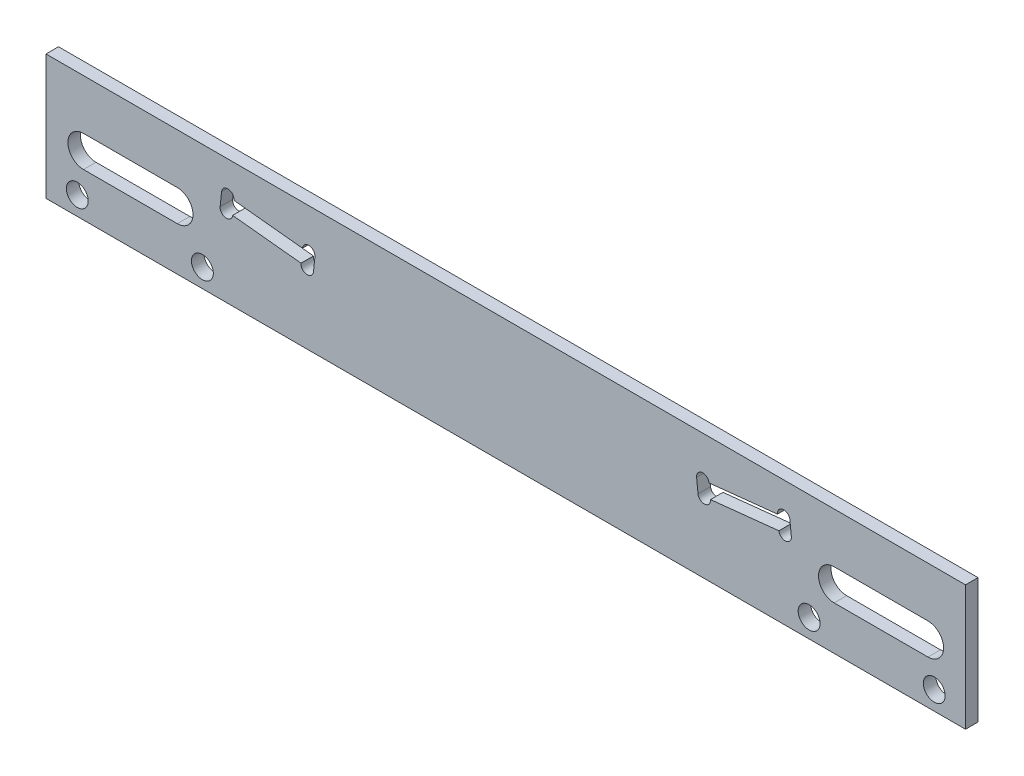
ISO-10303-21;
HEADER;
FILE_DESCRIPTION(('STEP AP214'),'2;1');
FILE_NAME('part.step','',(''),(''),'','','');
FILE_SCHEMA(('AUTOMOTIVE_DESIGN { 1 0 10303 214 1 1 1 1 }'));
ENDSEC;
DATA;
#1=APPLICATION_CONTEXT('core data for automotive mechanical design processes');
#2=APPLICATION_PROTOCOL_DEFINITION('international standard','automotive_design',2000,#1);
#3=PRODUCT_CONTEXT('',#1,'mechanical');
#4=PRODUCT('Part','Part','',(#3));
#5=PRODUCT_RELATED_PRODUCT_CATEGORY('part','',(#4));
#6=PRODUCT_DEFINITION_FORMATION('','',#4);
#7=PRODUCT_DEFINITION_CONTEXT('part definition',#1,'design');
#8=PRODUCT_DEFINITION('design','',#6,#7);
#9=PRODUCT_DEFINITION_SHAPE('','',#8);
#10=(LENGTH_UNIT() NAMED_UNIT(*) SI_UNIT(.MILLI.,.METRE.));
#11=(NAMED_UNIT(*) PLANE_ANGLE_UNIT() SI_UNIT($,.RADIAN.));
#12=(NAMED_UNIT(*) SI_UNIT($,.STERADIAN.) SOLID_ANGLE_UNIT());
#13=UNCERTAINTY_MEASURE_WITH_UNIT(LENGTH_MEASURE(1.E-05),#10,'distance_accuracy_value','');
#14=(GEOMETRIC_REPRESENTATION_CONTEXT(3) GLOBAL_UNCERTAINTY_ASSIGNED_CONTEXT((#13)) GLOBAL_UNIT_ASSIGNED_CONTEXT((#10,
#11,#12)) REPRESENTATION_CONTEXT('',''));
#15=CARTESIAN_POINT('',(0.,0.,0.));
#16=DIRECTION('',(0.,0.,1.));
#17=DIRECTION('',(1.,0.,0.));
#18=AXIS2_PLACEMENT_3D('',#15,#16,#17);
#19=CARTESIAN_POINT('',(0.,0.,2.));
#20=DIRECTION('',(0.,0.,1.));
#21=DIRECTION('',(1.,0.,0.));
#22=AXIS2_PLACEMENT_3D('',#19,#20,#21);
#23=PLANE('',#22);
#24=CARTESIAN_POINT('',(52.5,-0.499999999999997,2.));
#25=DIRECTION('',(0.,0.,1.));
#26=DIRECTION('',(1.,0.,0.));
#27=AXIS2_PLACEMENT_3D('',#24,#25,#26);
#28=CIRCLE('',#27,2.5);
#29=CARTESIAN_POINT('',(52.5,2.,2.));
#30=VERTEX_POINT('',#29);
#31=CARTESIAN_POINT('',(52.5,-3.,2.));
#32=VERTEX_POINT('',#31);
#33=EDGE_CURVE('E254',#30,#32,#28,.T.);
#34=ORIENTED_EDGE('',*,*,#33,.F.);
#35=DIRECTION('',(-1.,0.,0.));
#36=VECTOR('',#35,1.);
#37=CARTESIAN_POINT('',(52.5,2.,2.));
#38=LINE('',#37,#36);
#39=CARTESIAN_POINT('',(67.5,2.,2.));
#40=VERTEX_POINT('',#39);
#41=EDGE_CURVE('E262',#40,#30,#38,.T.);
#42=ORIENTED_EDGE('',*,*,#41,.F.);
#43=CARTESIAN_POINT('',(67.5,-0.499999999999997,2.));
#44=DIRECTION('',(0.,0.,1.));
#45=DIRECTION('',(1.,0.,0.));
#46=AXIS2_PLACEMENT_3D('',#43,#44,#45);
#47=CIRCLE('',#46,2.5);
#48=CARTESIAN_POINT('',(67.5,-3.,2.));
#49=VERTEX_POINT('',#48);
#50=EDGE_CURVE('E276',#49,#40,#47,.T.);
#51=ORIENTED_EDGE('',*,*,#50,.F.);
#52=DIRECTION('',(1.,0.,0.));
#53=VECTOR('',#52,1.);
#54=CARTESIAN_POINT('',(52.5,-3.,2.));
#55=LINE('',#54,#53);
#56=EDGE_CURVE('E273',#32,#49,#55,.T.);
#57=ORIENTED_EDGE('',*,*,#56,.F.);
#58=EDGE_LOOP('',(#34,#42,#51,#57));
#59=FACE_BOUND('',#58,.T.);
#60=CARTESIAN_POINT('',(-68.5,-6.99999999999999,2.));
#61=DIRECTION('',(0.,0.,-1.));
#62=DIRECTION('',(-1.,0.,0.));
#63=AXIS2_PLACEMENT_3D('',#60,#61,#62);
#64=CIRCLE('',#63,1.75);
#65=CARTESIAN_POINT('',(-70.25,-6.99999999999999,2.));
#66=VERTEX_POINT('',#65);
#67=EDGE_CURVE('E290',#66,#66,#64,.T.);
#68=ORIENTED_EDGE('',*,*,#67,.T.);
#69=EDGE_LOOP('',(#68));
#70=FACE_BOUND('',#69,.T.);
#71=CARTESIAN_POINT('',(-48.5,-7.,2.));
#72=DIRECTION('',(0.,0.,-1.));
#73=DIRECTION('',(-1.,0.,0.));
#74=AXIS2_PLACEMENT_3D('',#71,#72,#73);
#75=CIRCLE('',#74,1.75);
#76=CARTESIAN_POINT('',(-50.25,-7.,2.));
#77=VERTEX_POINT('',#76);
#78=EDGE_CURVE('E297',#77,#77,#75,.T.);
#79=ORIENTED_EDGE('',*,*,#78,.T.);
#80=EDGE_LOOP('',(#79));
#81=FACE_BOUND('',#80,.T.);
#82=CARTESIAN_POINT('',(48.5,-6.99999999999999,2.));
#83=DIRECTION('',(0.,0.,-1.));
#84=DIRECTION('',(-1.,0.,0.));
#85=AXIS2_PLACEMENT_3D('',#82,#83,#84);
#86=CIRCLE('',#85,1.75);
#87=CARTESIAN_POINT('',(46.75,-6.99999999999999,2.));
#88=VERTEX_POINT('',#87);
#89=EDGE_CURVE('E303',#88,#88,#86,.T.);
#90=ORIENTED_EDGE('',*,*,#89,.T.);
#91=EDGE_LOOP('',(#90));
#92=FACE_BOUND('',#91,.T.);
#93=CARTESIAN_POINT('',(68.4999999999999,-6.99999999999999,2.));
#94=DIRECTION('',(0.,0.,-1.));
#95=DIRECTION('',(-1.,0.,0.));
#96=AXIS2_PLACEMENT_3D('',#93,#94,#95);
#97=CIRCLE('',#96,1.75);
#98=CARTESIAN_POINT('',(66.7499999999999,-6.99999999999999,2.));
#99=VERTEX_POINT('',#98);
#100=EDGE_CURVE('E309',#99,#99,#97,.T.);
#101=ORIENTED_EDGE('',*,*,#100,.T.);
#102=EDGE_LOOP('',(#101));
#103=FACE_BOUND('',#102,.T.);
#104=CARTESIAN_POINT('',(31.7353868630574,1.31355228558448,2.));
#105=DIRECTION('',(0.,0.,1.));
#106=DIRECTION('',(1.,0.,0.));
#107=AXIS2_PLACEMENT_3D('',#104,#105,#106);
#108=CIRCLE('',#107,0.999999999999998);
#109=CARTESIAN_POINT('',(30.7408649676891,1.20902382231683,2.));
#110=VERTEX_POINT('',#109);
#111=CARTESIAN_POINT('',(32.7299087584256,1.41808074885212,2.));
#112=VERTEX_POINT('',#111);
#113=EDGE_CURVE('E374',#110,#112,#108,.T.);
#114=ORIENTED_EDGE('',*,*,#113,.F.);
#115=DIRECTION('',(0.104528463267649,-0.994521895368274,0.));
#116=VECTOR('',#115,1.);
#117=CARTESIAN_POINT('',(30.5109023485003,3.39697199212703,2.));
#118=LINE('',#117,#116);
#119=CARTESIAN_POINT('',(30.5109023485003,3.39697199212703,2.));
#120=VERTEX_POINT('',#119);
#121=EDGE_CURVE('E396',#120,#110,#118,.T.);
#122=ORIENTED_EDGE('',*,*,#121,.F.);
#123=CARTESIAN_POINT('',(31.5054242438685,3.50150045539468,2.));
#124=DIRECTION('',(0.,0.,1.));
#125=DIRECTION('',(1.,0.,0.));
#126=AXIS2_PLACEMENT_3D('',#123,#124,#125);
#127=CIRCLE('',#126,0.999999999999998);
#128=CARTESIAN_POINT('',(32.4999461392368,3.60602891866233,2.));
#129=VERTEX_POINT('',#128);
#130=EDGE_CURVE('E373',#129,#120,#127,.T.);
#131=ORIENTED_EDGE('',*,*,#130,.F.);
#132=DIRECTION('',(-0.994521895368274,-0.10452846326765,0.));
#133=VECTOR('',#132,1.);
#134=CARTESIAN_POINT('',(45.4287307790244,4.96489894114178,2.));
#135=LINE('',#134,#133);
#136=CARTESIAN_POINT('',(43.4396869882878,4.75584201460648,2.));
#137=VERTEX_POINT('',#136);
#138=EDGE_CURVE('E393',#137,#129,#135,.T.);
#139=ORIENTED_EDGE('',*,*,#138,.F.);
#140=CARTESIAN_POINT('',(44.4342088836561,4.86037047787413,2.));
#141=DIRECTION('',(0.,0.,1.));
#142=DIRECTION('',(1.,0.,0.));
#143=AXIS2_PLACEMENT_3D('',#140,#141,#142);
#144=CIRCLE('',#143,0.999999999999998);
#145=CARTESIAN_POINT('',(45.4287307790244,4.96489894114178,2.));
#146=VERTEX_POINT('',#145);
#147=EDGE_CURVE('E368',#146,#137,#144,.T.);
#148=ORIENTED_EDGE('',*,*,#147,.F.);
#149=DIRECTION('',(-0.104528463267651,0.994521895368274,0.));
#150=VECTOR('',#149,1.);
#151=CARTESIAN_POINT('',(45.6586933982132,2.77695077133158,2.));
#152=LINE('',#151,#150);
#153=CARTESIAN_POINT('',(45.6586933982132,2.77695077133158,2.));
#154=VERTEX_POINT('',#153);
#155=EDGE_CURVE('E402',#154,#146,#152,.T.);
#156=ORIENTED_EDGE('',*,*,#155,.F.);
#157=CARTESIAN_POINT('',(44.6641715028449,2.67242230806393,2.));
#158=DIRECTION('',(0.,0.,1.));
#159=DIRECTION('',(1.,0.,0.));
#160=AXIS2_PLACEMENT_3D('',#157,#158,#159);
#161=CIRCLE('',#160,0.999999999999998);
#162=CARTESIAN_POINT('',(43.6696496074767,2.56789384479628,2.));
#163=VERTEX_POINT('',#162);
#164=EDGE_CURVE('E357',#163,#154,#161,.T.);
#165=ORIENTED_EDGE('',*,*,#164,.F.);
#166=DIRECTION('',(0.994521895368274,0.10452846326765,0.));
#167=VECTOR('',#166,1.);
#168=CARTESIAN_POINT('',(30.7408649676891,1.20902382231683,2.));
#169=LINE('',#168,#167);
#170=EDGE_CURVE('E399',#112,#163,#169,.T.);
#171=ORIENTED_EDGE('',*,*,#170,.F.);
#172=EDGE_LOOP('',(#114,#122,#131,#139,#148,#156,#165,#171));
#173=FACE_BOUND('',#172,.T.);
#174=DIRECTION('',(0.,1.,0.));
#175=VECTOR('',#174,1.);
#176=CARTESIAN_POINT('',(73.5,10.,2.));
#177=LINE('',#176,#175);
#178=CARTESIAN_POINT('',(73.5,-10.,2.));
#179=VERTEX_POINT('',#178);
#180=CARTESIAN_POINT('',(73.5,10.,2.));
#181=VERTEX_POINT('',#180);
#182=EDGE_CURVE('E416',#179,#181,#177,.T.);
#183=ORIENTED_EDGE('',*,*,#182,.T.);
#184=DIRECTION('',(-1.,0.,0.));
#185=VECTOR('',#184,1.);
#186=CARTESIAN_POINT('',(-73.5,10.,2.));
#187=LINE('',#186,#185);
#188=CARTESIAN_POINT('',(-73.5,10.,2.));
#189=VERTEX_POINT('',#188);
#190=EDGE_CURVE('E419',#181,#189,#187,.T.);
#191=ORIENTED_EDGE('',*,*,#190,.T.);
#192=DIRECTION('',(0.,-1.,0.));
#193=VECTOR('',#192,1.);
#194=CARTESIAN_POINT('',(-73.5,10.,2.));
#195=LINE('',#194,#193);
#196=CARTESIAN_POINT('',(-73.5,-10.,2.));
#197=VERTEX_POINT('',#196);
#198=EDGE_CURVE('E422',#189,#197,#195,.T.);
#199=ORIENTED_EDGE('',*,*,#198,.T.);
#200=DIRECTION('',(1.,0.,0.));
#201=VECTOR('',#200,1.);
#202=CARTESIAN_POINT('',(-73.5,-10.,2.));
#203=LINE('',#202,#201);
#204=EDGE_CURVE('E424',#197,#179,#203,.T.);
#205=ORIENTED_EDGE('',*,*,#204,.T.);
#206=EDGE_LOOP('',(#183,#191,#199,#205));
#207=FACE_BOUND('',#206,.T.);
#208=DIRECTION('',(-0.104528463267649,-0.994521895368274,0.));
#209=VECTOR('',#208,1.);
#210=CARTESIAN_POINT('',(-30.5109023485003,3.39697199212703,2.));
#211=LINE('',#210,#209);
#212=CARTESIAN_POINT('',(-30.5109023485003,3.39697199212703,2.));
#213=VERTEX_POINT('',#212);
#214=CARTESIAN_POINT('',(-30.7408649676891,1.20902382231683,2.));
#215=VERTEX_POINT('',#214);
#216=EDGE_CURVE('E351',#213,#215,#211,.T.);
#217=ORIENTED_EDGE('',*,*,#216,.T.);
#218=CARTESIAN_POINT('',(-31.7353868630574,1.31355228558448,2.));
#219=DIRECTION('',(0.,0.,-1.));
#220=DIRECTION('',(-1.,0.,0.));
#221=AXIS2_PLACEMENT_3D('',#218,#219,#220);
#222=CIRCLE('',#221,0.999999999999998);
#223=CARTESIAN_POINT('',(-32.7299087584256,1.41808074885212,2.));
#224=VERTEX_POINT('',#223);
#225=EDGE_CURVE('E322',#215,#224,#222,.T.);
#226=ORIENTED_EDGE('',*,*,#225,.T.);
#227=DIRECTION('',(-0.994521895368274,0.10452846326765,0.));
#228=VECTOR('',#227,1.);
#229=CARTESIAN_POINT('',(-30.7408649676891,1.20902382231683,2.));
#230=LINE('',#229,#228);
#231=CARTESIAN_POINT('',(-43.6696496074767,2.56789384479628,2.));
#232=VERTEX_POINT('',#231);
#233=EDGE_CURVE('E348',#224,#232,#230,.T.);
#234=ORIENTED_EDGE('',*,*,#233,.T.);
#235=CARTESIAN_POINT('',(-44.6641715028449,2.67242230806393,2.));
#236=DIRECTION('',(0.,0.,-1.));
#237=DIRECTION('',(-1.,0.,0.));
#238=AXIS2_PLACEMENT_3D('',#235,#236,#237);
#239=CIRCLE('',#238,0.999999999999998);
#240=CARTESIAN_POINT('',(-45.6586933982132,2.77695077133158,2.));
#241=VERTEX_POINT('',#240);
#242=EDGE_CURVE('E293',#232,#241,#239,.T.);
#243=ORIENTED_EDGE('',*,*,#242,.T.);
#244=DIRECTION('',(0.104528463267651,0.994521895368274,0.));
#245=VECTOR('',#244,1.);
#246=CARTESIAN_POINT('',(-45.6586933982132,2.77695077133158,2.));
#247=LINE('',#246,#245);
#248=CARTESIAN_POINT('',(-45.4287307790244,4.96489894114178,2.));
#249=VERTEX_POINT('',#248);
#250=EDGE_CURVE('E345',#241,#249,#247,.T.);
#251=ORIENTED_EDGE('',*,*,#250,.T.);
#252=CARTESIAN_POINT('',(-44.4342088836561,4.86037047787413,2.));
#253=DIRECTION('',(0.,0.,-1.));
#254=DIRECTION('',(-1.,0.,0.));
#255=AXIS2_PLACEMENT_3D('',#252,#253,#254);
#256=CIRCLE('',#255,0.999999999999998);
#257=CARTESIAN_POINT('',(-43.4396869882878,4.75584201460648,2.));
#258=VERTEX_POINT('',#257);
#259=EDGE_CURVE('E316',#249,#258,#256,.T.);
#260=ORIENTED_EDGE('',*,*,#259,.T.);
#261=DIRECTION('',(0.994521895368274,-0.10452846326765,0.));
#262=VECTOR('',#261,1.);
#263=CARTESIAN_POINT('',(-45.4287307790244,4.96489894114178,2.));
#264=LINE('',#263,#262);
#265=CARTESIAN_POINT('',(-32.4999461392368,3.60602891866233,2.));
#266=VERTEX_POINT('',#265);
#267=EDGE_CURVE('E342',#258,#266,#264,.T.);
#268=ORIENTED_EDGE('',*,*,#267,.T.);
#269=CARTESIAN_POINT('',(-31.5054242438685,3.50150045539468,2.));
#270=DIRECTION('',(0.,0.,-1.));
#271=DIRECTION('',(-1.,0.,0.));
#272=AXIS2_PLACEMENT_3D('',#269,#270,#271);
#273=CIRCLE('',#272,0.999999999999998);
#274=EDGE_CURVE('E321',#266,#213,#273,.T.);
#275=ORIENTED_EDGE('',*,*,#274,.T.);
#276=EDGE_LOOP('',(#217,#226,#234,#243,#251,#260,#268,#275));
#277=FACE_BOUND('',#276,.T.);
#278=DIRECTION('',(1.,0.,0.));
#279=VECTOR('',#278,1.);
#280=CARTESIAN_POINT('',(-52.5,2.,2.));
#281=LINE('',#280,#279);
#282=CARTESIAN_POINT('',(-67.5,2.,2.));
#283=VERTEX_POINT('',#282);
#284=CARTESIAN_POINT('',(-52.5,2.,2.));
#285=VERTEX_POINT('',#284);
#286=EDGE_CURVE('E248',#283,#285,#281,.T.);
#287=ORIENTED_EDGE('',*,*,#286,.T.);
#288=CARTESIAN_POINT('',(-52.5,-0.499999999999997,2.));
#289=DIRECTION('',(0.,0.,-1.));
#290=DIRECTION('',(-1.,0.,0.));
#291=AXIS2_PLACEMENT_3D('',#288,#289,#290);
#292=CIRCLE('',#291,2.5);
#293=CARTESIAN_POINT('',(-52.5,-3.,2.));
#294=VERTEX_POINT('',#293);
#295=EDGE_CURVE('E53',#285,#294,#292,.T.);
#296=ORIENTED_EDGE('',*,*,#295,.T.);
#297=DIRECTION('',(-1.,0.,0.));
#298=VECTOR('',#297,1.);
#299=CARTESIAN_POINT('',(-52.5,-3.,2.));
#300=LINE('',#299,#298);
#301=CARTESIAN_POINT('',(-67.5,-3.,2.));
#302=VERTEX_POINT('',#301);
#303=EDGE_CURVE('E239',#294,#302,#300,.T.);
#304=ORIENTED_EDGE('',*,*,#303,.T.);
#305=CARTESIAN_POINT('',(-67.5,-0.499999999999997,2.));
#306=DIRECTION('',(0.,0.,-1.));
#307=DIRECTION('',(-1.,0.,0.));
#308=AXIS2_PLACEMENT_3D('',#305,#306,#307);
#309=CIRCLE('',#308,2.5);
#310=EDGE_CURVE('E242',#302,#283,#309,.T.);
#311=ORIENTED_EDGE('',*,*,#310,.T.);
#312=EDGE_LOOP('',(#287,#296,#304,#311));
#313=FACE_BOUND('',#312,.T.);
#314=ADVANCED_FACE('F38',(#59,#70,#81,#92,#103,#173,#207,#277,#313),#23,.T.);
#315=CARTESIAN_POINT('',(0.,0.,0.));
#316=DIRECTION('',(0.,0.,1.));
#317=DIRECTION('',(1.,0.,0.));
#318=AXIS2_PLACEMENT_3D('',#315,#316,#317);
#319=PLANE('',#318);
#320=DIRECTION('',(0.104528463267649,-0.994521895368274,0.));
#321=VECTOR('',#320,1.);
#322=CARTESIAN_POINT('',(30.5306692337265,3.20890264196001,0.));
#323=LINE('',#322,#321);
#324=CARTESIAN_POINT('',(30.5109023485003,3.39697199212703,0.));
#325=VERTEX_POINT('',#324);
#326=CARTESIAN_POINT('',(30.7408649676891,1.20902382231683,0.));
#327=VERTEX_POINT('',#326);
#328=EDGE_CURVE('E445',#325,#327,#323,.T.);
#329=ORIENTED_EDGE('',*,*,#328,.T.);
#330=CARTESIAN_POINT('',(31.7353868630574,1.31355228558448,0.));
#331=DIRECTION('',(0.,0.,1.));
#332=DIRECTION('',(1.,0.,0.));
#333=AXIS2_PLACEMENT_3D('',#330,#331,#332);
#334=CIRCLE('',#333,0.999999999999998);
#335=CARTESIAN_POINT('',(32.7299087584256,1.41808074885212,0.));
#336=VERTEX_POINT('',#335);
#337=EDGE_CURVE('E370',#327,#336,#334,.T.);
#338=ORIENTED_EDGE('',*,*,#337,.T.);
#339=DIRECTION('',(0.994521895368274,0.10452846326765,0.));
#340=VECTOR('',#339,1.);
#341=CARTESIAN_POINT('',(0.210195733962616,-1.9998788196432,0.));
#342=LINE('',#341,#340);
#343=CARTESIAN_POINT('',(43.6696496074767,2.56789384479628,0.));
#344=VERTEX_POINT('',#343);
#345=EDGE_CURVE('E448',#336,#344,#342,.T.);
#346=ORIENTED_EDGE('',*,*,#345,.T.);
#347=CARTESIAN_POINT('',(44.6641715028449,2.67242230806393,0.));
#348=DIRECTION('',(0.,0.,1.));
#349=DIRECTION('',(1.,0.,0.));
#350=AXIS2_PLACEMENT_3D('',#347,#348,#349);
#351=CIRCLE('',#350,0.999999999999998);
#352=CARTESIAN_POINT('',(45.6586933982132,2.77695077133158,0.));
#353=VERTEX_POINT('',#352);
#354=EDGE_CURVE('E365',#344,#353,#351,.T.);
#355=ORIENTED_EDGE('',*,*,#354,.T.);
#356=DIRECTION('',(-0.104528463267651,0.994521895368274,0.));
#357=VECTOR('',#356,1.);
#358=CARTESIAN_POINT('',(45.4484976642506,4.77682959097483,0.));
#359=LINE('',#358,#357);
#360=CARTESIAN_POINT('',(45.4287307790244,4.96489894114178,0.));
#361=VERTEX_POINT('',#360);
#362=EDGE_CURVE('E451',#353,#361,#359,.T.);
#363=ORIENTED_EDGE('',*,*,#362,.T.);
#364=CARTESIAN_POINT('',(44.4342088836561,4.86037047787413,0.));
#365=DIRECTION('',(0.,0.,1.));
#366=DIRECTION('',(1.,0.,0.));
#367=AXIS2_PLACEMENT_3D('',#364,#365,#366);
#368=CIRCLE('',#367,0.999999999999998);
#369=CARTESIAN_POINT('',(43.4396869882878,4.75584201460648,0.));
#370=VERTEX_POINT('',#369);
#371=EDGE_CURVE('E376',#361,#370,#368,.T.);
#372=ORIENTED_EDGE('',*,*,#371,.T.);
#373=DIRECTION('',(-0.994521895368274,-0.10452846326765,0.));
#374=VECTOR('',#373,1.);
#375=CARTESIAN_POINT('',(-0.0197668852262152,0.188069350167006,0.));
#376=LINE('',#375,#374);
#377=CARTESIAN_POINT('',(32.4999461392368,3.60602891866233,0.));
#378=VERTEX_POINT('',#377);
#379=EDGE_CURVE('E454',#370,#378,#376,.T.);
#380=ORIENTED_EDGE('',*,*,#379,.T.);
#381=CARTESIAN_POINT('',(31.5054242438685,3.50150045539468,0.));
#382=DIRECTION('',(0.,0.,1.));
#383=DIRECTION('',(1.,0.,0.));
#384=AXIS2_PLACEMENT_3D('',#381,#382,#383);
#385=CIRCLE('',#384,0.999999999999998);
#386=EDGE_CURVE('E380',#378,#325,#385,.T.);
#387=ORIENTED_EDGE('',*,*,#386,.T.);
#388=EDGE_LOOP('',(#329,#338,#346,#355,#363,#372,#380,#387));
#389=FACE_BOUND('',#388,.T.);
#390=DIRECTION('',(0.,1.,0.));
#391=VECTOR('',#390,1.);
#392=CARTESIAN_POINT('',(73.5,10.,0.));
#393=LINE('',#392,#391);
#394=CARTESIAN_POINT('',(73.5,-10.,0.));
#395=VERTEX_POINT('',#394);
#396=CARTESIAN_POINT('',(73.5,10.,0.));
#397=VERTEX_POINT('',#396);
#398=EDGE_CURVE('E408',#395,#397,#393,.T.);
#399=ORIENTED_EDGE('',*,*,#398,.F.);
#400=DIRECTION('',(1.,0.,0.));
#401=VECTOR('',#400,1.);
#402=CARTESIAN_POINT('',(-73.5,-10.,0.));
#403=LINE('',#402,#401);
#404=CARTESIAN_POINT('',(-73.5,-10.,0.));
#405=VERTEX_POINT('',#404);
#406=EDGE_CURVE('E420',#405,#395,#403,.T.);
#407=ORIENTED_EDGE('',*,*,#406,.F.);
#408=DIRECTION('',(0.,-1.,0.));
#409=VECTOR('',#408,1.);
#410=CARTESIAN_POINT('',(-73.5,10.,0.));
#411=LINE('',#410,#409);
#412=CARTESIAN_POINT('',(-73.5,10.,0.));
#413=VERTEX_POINT('',#412);
#414=EDGE_CURVE('E431',#413,#405,#411,.T.);
#415=ORIENTED_EDGE('',*,*,#414,.F.);
#416=DIRECTION('',(-1.,0.,0.));
#417=VECTOR('',#416,1.);
#418=CARTESIAN_POINT('',(-73.5,10.,0.));
#419=LINE('',#418,#417);
#420=EDGE_CURVE('E429',#397,#413,#419,.T.);
#421=ORIENTED_EDGE('',*,*,#420,.F.);
#422=EDGE_LOOP('',(#399,#407,#415,#421));
#423=FACE_BOUND('',#422,.T.);
#424=CARTESIAN_POINT('',(-31.7353868630574,1.31355228558448,0.));
#425=DIRECTION('',(0.,0.,-1.));
#426=DIRECTION('',(-1.,0.,0.));
#427=AXIS2_PLACEMENT_3D('',#424,#425,#426);
#428=CIRCLE('',#427,0.999999999999998);
#429=CARTESIAN_POINT('',(-30.7408649676891,1.20902382231683,0.));
#430=VERTEX_POINT('',#429);
#431=CARTESIAN_POINT('',(-32.7299087584256,1.41808074885212,0.));
#432=VERTEX_POINT('',#431);
#433=EDGE_CURVE('E319',#430,#432,#428,.T.);
#434=ORIENTED_EDGE('',*,*,#433,.F.);
#435=DIRECTION('',(-0.104528463267649,-0.994521895368274,0.));
#436=VECTOR('',#435,1.);
#437=CARTESIAN_POINT('',(-30.5306692337265,3.20890264196001,0.));
#438=LINE('',#437,#436);
#439=CARTESIAN_POINT('',(-30.5109023485003,3.39697199212703,0.));
#440=VERTEX_POINT('',#439);
#441=EDGE_CURVE('E466',#440,#430,#438,.T.);
#442=ORIENTED_EDGE('',*,*,#441,.F.);
#443=CARTESIAN_POINT('',(-31.5054242438685,3.50150045539468,0.));
#444=DIRECTION('',(0.,0.,-1.));
#445=DIRECTION('',(-1.,0.,0.));
#446=AXIS2_PLACEMENT_3D('',#443,#444,#445);
#447=CIRCLE('',#446,0.999999999999998);
#448=CARTESIAN_POINT('',(-32.4999461392368,3.60602891866233,0.));
#449=VERTEX_POINT('',#448);
#450=EDGE_CURVE('E329',#449,#440,#447,.T.);
#451=ORIENTED_EDGE('',*,*,#450,.F.);
#452=DIRECTION('',(0.994521895368274,-0.10452846326765,0.));
#453=VECTOR('',#452,1.);
#454=CARTESIAN_POINT('',(0.0197668852262152,0.188069350167006,0.));
#455=LINE('',#454,#453);
#456=CARTESIAN_POINT('',(-43.4396869882878,4.75584201460648,0.));
#457=VERTEX_POINT('',#456);
#458=EDGE_CURVE('E46',#457,#449,#455,.T.);
#459=ORIENTED_EDGE('',*,*,#458,.F.);
#460=CARTESIAN_POINT('',(-44.4342088836561,4.86037047787413,0.));
#461=DIRECTION('',(0.,0.,-1.));
#462=DIRECTION('',(-1.,0.,0.));
#463=AXIS2_PLACEMENT_3D('',#460,#461,#462);
#464=CIRCLE('',#463,0.999999999999998);
#465=CARTESIAN_POINT('',(-45.4287307790244,4.96489894114178,0.));
#466=VERTEX_POINT('',#465);
#467=EDGE_CURVE('E325',#466,#457,#464,.T.);
#468=ORIENTED_EDGE('',*,*,#467,.F.);
#469=DIRECTION('',(0.104528463267651,0.994521895368274,0.));
#470=VECTOR('',#469,1.);
#471=CARTESIAN_POINT('',(-45.4484976642506,4.77682959097483,0.));
#472=LINE('',#471,#470);
#473=CARTESIAN_POINT('',(-45.6586933982132,2.77695077133158,0.));
#474=VERTEX_POINT('',#473);
#475=EDGE_CURVE('E460',#474,#466,#472,.T.);
#476=ORIENTED_EDGE('',*,*,#475,.F.);
#477=CARTESIAN_POINT('',(-44.6641715028449,2.67242230806393,0.));
#478=DIRECTION('',(0.,0.,-1.));
#479=DIRECTION('',(-1.,0.,0.));
#480=AXIS2_PLACEMENT_3D('',#477,#478,#479);
#481=CIRCLE('',#480,0.999999999999998);
#482=CARTESIAN_POINT('',(-43.6696496074767,2.56789384479628,0.));
#483=VERTEX_POINT('',#482);
#484=EDGE_CURVE('E314',#483,#474,#481,.T.);
#485=ORIENTED_EDGE('',*,*,#484,.F.);
#486=DIRECTION('',(-0.994521895368274,0.10452846326765,0.));
#487=VECTOR('',#486,1.);
#488=CARTESIAN_POINT('',(-0.210195733962616,-1.9998788196432,0.));
#489=LINE('',#488,#487);
#490=EDGE_CURVE('E463',#432,#483,#489,.T.);
#491=ORIENTED_EDGE('',*,*,#490,.F.);
#492=EDGE_LOOP('',(#434,#442,#451,#459,#468,#476,#485,#491));
#493=FACE_BOUND('',#492,.T.);
#494=CARTESIAN_POINT('',(68.4999999999999,-6.99999999999999,0.));
#495=DIRECTION('',(0.,0.,-1.));
#496=DIRECTION('',(-1.,0.,0.));
#497=AXIS2_PLACEMENT_3D('',#494,#495,#496);
#498=CIRCLE('',#497,1.75);
#499=CARTESIAN_POINT('',(66.7499999999999,-6.99999999999999,0.));
#500=VERTEX_POINT('',#499);
#501=EDGE_CURVE('E283',#500,#500,#498,.T.);
#502=ORIENTED_EDGE('',*,*,#501,.F.);
#503=EDGE_LOOP('',(#502));
#504=FACE_BOUND('',#503,.T.);
#505=CARTESIAN_POINT('',(48.5,-6.99999999999999,0.));
#506=DIRECTION('',(0.,0.,-1.));
#507=DIRECTION('',(-1.,0.,0.));
#508=AXIS2_PLACEMENT_3D('',#505,#506,#507);
#509=CIRCLE('',#508,1.75);
#510=CARTESIAN_POINT('',(46.75,-6.99999999999999,0.));
#511=VERTEX_POINT('',#510);
#512=EDGE_CURVE('E306',#511,#511,#509,.T.);
#513=ORIENTED_EDGE('',*,*,#512,.F.);
#514=EDGE_LOOP('',(#513));
#515=FACE_BOUND('',#514,.T.);
#516=CARTESIAN_POINT('',(-48.5,-7.,0.));
#517=DIRECTION('',(0.,0.,-1.));
#518=DIRECTION('',(-1.,0.,0.));
#519=AXIS2_PLACEMENT_3D('',#516,#517,#518);
#520=CIRCLE('',#519,1.75);
#521=CARTESIAN_POINT('',(-50.25,-7.,0.));
#522=VERTEX_POINT('',#521);
#523=EDGE_CURVE('E300',#522,#522,#520,.T.);
#524=ORIENTED_EDGE('',*,*,#523,.F.);
#525=EDGE_LOOP('',(#524));
#526=FACE_BOUND('',#525,.T.);
#527=CARTESIAN_POINT('',(-68.5,-6.99999999999999,0.));
#528=DIRECTION('',(0.,0.,-1.));
#529=DIRECTION('',(-1.,0.,0.));
#530=AXIS2_PLACEMENT_3D('',#527,#528,#529);
#531=CIRCLE('',#530,1.75);
#532=CARTESIAN_POINT('',(-70.25,-6.99999999999999,0.));
#533=VERTEX_POINT('',#532);
#534=EDGE_CURVE('E294',#533,#533,#531,.T.);
#535=ORIENTED_EDGE('',*,*,#534,.F.);
#536=EDGE_LOOP('',(#535));
#537=FACE_BOUND('',#536,.T.);
#538=DIRECTION('',(-1.,0.,0.));
#539=VECTOR('',#538,1.);
#540=CARTESIAN_POINT('',(52.5,2.,0.));
#541=LINE('',#540,#539);
#542=CARTESIAN_POINT('',(67.5,2.,0.));
#543=VERTEX_POINT('',#542);
#544=CARTESIAN_POINT('',(52.5,2.,0.));
#545=VERTEX_POINT('',#544);
#546=EDGE_CURVE('E268',#543,#545,#541,.T.);
#547=ORIENTED_EDGE('',*,*,#546,.T.);
#548=CARTESIAN_POINT('',(52.5,-0.499999999999997,0.));
#549=DIRECTION('',(0.,0.,1.));
#550=DIRECTION('',(1.,0.,0.));
#551=AXIS2_PLACEMENT_3D('',#548,#549,#550);
#552=CIRCLE('',#551,2.5);
#553=CARTESIAN_POINT('',(52.5,-3.,0.));
#554=VERTEX_POINT('',#553);
#555=EDGE_CURVE('E258',#545,#554,#552,.T.);
#556=ORIENTED_EDGE('',*,*,#555,.T.);
#557=DIRECTION('',(1.,0.,0.));
#558=VECTOR('',#557,1.);
#559=CARTESIAN_POINT('',(52.5,-3.,0.));
#560=LINE('',#559,#558);
#561=CARTESIAN_POINT('',(67.5,-3.,0.));
#562=VERTEX_POINT('',#561);
#563=EDGE_CURVE('E261',#554,#562,#560,.T.);
#564=ORIENTED_EDGE('',*,*,#563,.T.);
#565=CARTESIAN_POINT('',(67.5,-0.499999999999997,0.));
#566=DIRECTION('',(0.,0.,1.));
#567=DIRECTION('',(1.,0.,0.));
#568=AXIS2_PLACEMENT_3D('',#565,#566,#567);
#569=CIRCLE('',#568,2.5);
#570=EDGE_CURVE('E265',#562,#543,#569,.T.);
#571=ORIENTED_EDGE('',*,*,#570,.T.);
#572=EDGE_LOOP('',(#547,#556,#564,#571));
#573=FACE_BOUND('',#572,.T.);
#574=CARTESIAN_POINT('',(-52.5,-0.499999999999997,0.));
#575=DIRECTION('',(0.,0.,-1.));
#576=DIRECTION('',(-1.,0.,0.));
#577=AXIS2_PLACEMENT_3D('',#574,#575,#576);
#578=CIRCLE('',#577,2.5);
#579=CARTESIAN_POINT('',(-52.5,2.,0.));
#580=VERTEX_POINT('',#579);
#581=CARTESIAN_POINT('',(-52.5,-3.,0.));
#582=VERTEX_POINT('',#581);
#583=EDGE_CURVE('E231',#580,#582,#578,.T.);
#584=ORIENTED_EDGE('',*,*,#583,.F.);
#585=DIRECTION('',(1.,0.,0.));
#586=VECTOR('',#585,1.);
#587=CARTESIAN_POINT('',(-52.5,2.,0.));
#588=LINE('',#587,#586);
#589=CARTESIAN_POINT('',(-67.5,2.,0.));
#590=VERTEX_POINT('',#589);
#591=EDGE_CURVE('E223',#590,#580,#588,.T.);
#592=ORIENTED_EDGE('',*,*,#591,.F.);
#593=CARTESIAN_POINT('',(-67.5,-0.499999999999997,0.));
#594=DIRECTION('',(0.,0.,-1.));
#595=DIRECTION('',(-1.,0.,0.));
#596=AXIS2_PLACEMENT_3D('',#593,#594,#595);
#597=CIRCLE('',#596,2.5);
#598=CARTESIAN_POINT('',(-67.5,-3.,0.));
#599=VERTEX_POINT('',#598);
#600=EDGE_CURVE('E230',#599,#590,#597,.T.);
#601=ORIENTED_EDGE('',*,*,#600,.F.);
#602=DIRECTION('',(-1.,0.,0.));
#603=VECTOR('',#602,1.);
#604=CARTESIAN_POINT('',(-52.5,-3.,0.));
#605=LINE('',#604,#603);
#606=EDGE_CURVE('E235',#582,#599,#605,.T.);
#607=ORIENTED_EDGE('',*,*,#606,.F.);
#608=EDGE_LOOP('',(#584,#592,#601,#607));
#609=FACE_BOUND('',#608,.T.);
#610=ADVANCED_FACE('F238',(#389,#423,#493,#504,#515,#526,#537,#573,#609),#319,.F.);
#611=CARTESIAN_POINT('',(-45.4287307790244,4.96489894114178,-1.));
#612=DIRECTION('',(-0.10452846326765,-0.994521895368274,0.));
#613=DIRECTION('',(0.994521895368274,-0.10452846326765,0.));
#614=AXIS2_PLACEMENT_3D('',#611,#612,#613);
#615=PLANE('',#614);
#616=ORIENTED_EDGE('',*,*,#267,.F.);
#617=DIRECTION('',(0.,0.,1.));
#618=VECTOR('',#617,1.);
#619=CARTESIAN_POINT('',(-43.4396869882878,4.75584201460648,0.));
#620=LINE('',#619,#618);
#621=EDGE_CURVE('E336',#258,#457,#620,.F.);
#622=ORIENTED_EDGE('',*,*,#621,.T.);
#623=ORIENTED_EDGE('',*,*,#458,.T.);
#624=DIRECTION('',(0.,0.,1.));
#625=VECTOR('',#624,1.);
#626=CARTESIAN_POINT('',(-32.4999461392368,3.60602891866233,0.));
#627=LINE('',#626,#625);
#628=EDGE_CURVE('E339',#449,#266,#627,.T.);
#629=ORIENTED_EDGE('',*,*,#628,.T.);
#630=EDGE_LOOP('',(#616,#622,#623,#629));
#631=FACE_BOUND('',#630,.T.);
#632=ADVANCED_FACE('F472',(#631),#615,.T.);
#633=CARTESIAN_POINT('',(-30.7408649676891,1.20902382231683,-1.));
#634=DIRECTION('',(0.10452846326765,0.994521895368274,0.));
#635=DIRECTION('',(-0.994521895368274,0.10452846326765,0.));
#636=AXIS2_PLACEMENT_3D('',#633,#634,#635);
#637=PLANE('',#636);
#638=ORIENTED_EDGE('',*,*,#233,.F.);
#639=DIRECTION('',(0.,0.,1.));
#640=VECTOR('',#639,1.);
#641=CARTESIAN_POINT('',(-32.7299087584256,1.41808074885212,0.));
#642=LINE('',#641,#640);
#643=EDGE_CURVE('E11',#224,#432,#642,.F.);
#644=ORIENTED_EDGE('',*,*,#643,.T.);
#645=ORIENTED_EDGE('',*,*,#490,.T.);
#646=DIRECTION('',(0.,0.,1.));
#647=VECTOR('',#646,1.);
#648=CARTESIAN_POINT('',(-43.6696496074767,2.56789384479628,0.));
#649=LINE('',#648,#647);
#650=EDGE_CURVE('E331',#483,#232,#649,.T.);
#651=ORIENTED_EDGE('',*,*,#650,.T.);
#652=EDGE_LOOP('',(#638,#644,#645,#651));
#653=FACE_BOUND('',#652,.T.);
#654=ADVANCED_FACE('F499',(#653),#637,.T.);
#655=CARTESIAN_POINT('',(73.5,10.,2.));
#656=DIRECTION('',(-1.,0.,0.));
#657=DIRECTION('',(0.,-1.,0.));
#658=AXIS2_PLACEMENT_3D('',#655,#656,#657);
#659=PLANE('',#658);
#660=ORIENTED_EDGE('',*,*,#398,.T.);
#661=DIRECTION('',(0.,0.,-1.));
#662=VECTOR('',#661,1.);
#663=CARTESIAN_POINT('',(73.5,10.,2.));
#664=LINE('',#663,#662);
#665=EDGE_CURVE('E442',#181,#397,#664,.T.);
#666=ORIENTED_EDGE('',*,*,#665,.F.);
#667=ORIENTED_EDGE('',*,*,#182,.F.);
#668=DIRECTION('',(0.,0.,-1.));
#669=VECTOR('',#668,1.);
#670=CARTESIAN_POINT('',(73.5,-10.,2.));
#671=LINE('',#670,#669);
#672=EDGE_CURVE('E426',#179,#395,#671,.T.);
#673=ORIENTED_EDGE('',*,*,#672,.T.);
#674=EDGE_LOOP('',(#660,#666,#667,#673));
#675=FACE_BOUND('',#674,.T.);
#676=ADVANCED_FACE('F40',(#675),#659,.F.);
#677=CARTESIAN_POINT('',(-73.5,10.,2.));
#678=DIRECTION('',(0.,-1.,0.));
#679=DIRECTION('',(0.,0.,-1.));
#680=AXIS2_PLACEMENT_3D('',#677,#678,#679);
#681=PLANE('',#680);
#682=ORIENTED_EDGE('',*,*,#420,.T.);
#683=DIRECTION('',(0.,0.,-1.));
#684=VECTOR('',#683,1.);
#685=CARTESIAN_POINT('',(-73.5,10.,2.));
#686=LINE('',#685,#684);
#687=EDGE_CURVE('E439',#189,#413,#686,.T.);
#688=ORIENTED_EDGE('',*,*,#687,.F.);
#689=ORIENTED_EDGE('',*,*,#190,.F.);
#690=ORIENTED_EDGE('',*,*,#665,.T.);
#691=EDGE_LOOP('',(#682,#688,#689,#690));
#692=FACE_BOUND('',#691,.T.);
#693=ADVANCED_FACE('F533',(#692),#681,.F.);
#694=CARTESIAN_POINT('',(-73.5,10.,2.));
#695=DIRECTION('',(1.,0.,0.));
#696=DIRECTION('',(0.,0.,-1.));
#697=AXIS2_PLACEMENT_3D('',#694,#695,#696);
#698=PLANE('',#697);
#699=ORIENTED_EDGE('',*,*,#414,.T.);
#700=DIRECTION('',(0.,0.,-1.));
#701=VECTOR('',#700,1.);
#702=CARTESIAN_POINT('',(-73.5,-10.,2.));
#703=LINE('',#702,#701);
#704=EDGE_CURVE('E436',#197,#405,#703,.T.);
#705=ORIENTED_EDGE('',*,*,#704,.F.);
#706=ORIENTED_EDGE('',*,*,#198,.F.);
#707=ORIENTED_EDGE('',*,*,#687,.T.);
#708=EDGE_LOOP('',(#699,#705,#706,#707));
#709=FACE_BOUND('',#708,.T.);
#710=ADVANCED_FACE('F530',(#709),#698,.F.);
#711=CARTESIAN_POINT('',(-73.5,-10.,2.));
#712=DIRECTION('',(0.,1.,0.));
#713=DIRECTION('',(0.,0.,1.));
#714=AXIS2_PLACEMENT_3D('',#711,#712,#713);
#715=PLANE('',#714);
#716=ORIENTED_EDGE('',*,*,#406,.T.);
#717=ORIENTED_EDGE('',*,*,#672,.F.);
#718=ORIENTED_EDGE('',*,*,#204,.F.);
#719=ORIENTED_EDGE('',*,*,#704,.T.);
#720=EDGE_LOOP('',(#716,#717,#718,#719));
#721=FACE_BOUND('',#720,.T.);
#722=ADVANCED_FACE('F527',(#721),#715,.F.);
#723=CARTESIAN_POINT('',(45.4287307790244,4.96489894114178,-1.));
#724=DIRECTION('',(-0.10452846326765,0.994521895368274,0.));
#725=DIRECTION('',(-0.994521895368274,-0.10452846326765,0.));
#726=AXIS2_PLACEMENT_3D('',#723,#724,#725);
#727=PLANE('',#726);
#728=ORIENTED_EDGE('',*,*,#379,.F.);
#729=DIRECTION('',(0.,0.,1.));
#730=VECTOR('',#729,1.);
#731=CARTESIAN_POINT('',(43.4396869882878,4.75584201460648,0.));
#732=LINE('',#731,#730);
#733=EDGE_CURVE('E390',#370,#137,#732,.T.);
#734=ORIENTED_EDGE('',*,*,#733,.T.);
#735=ORIENTED_EDGE('',*,*,#138,.T.);
#736=DIRECTION('',(0.,0.,1.));
#737=VECTOR('',#736,1.);
#738=CARTESIAN_POINT('',(32.4999461392368,3.60602891866233,0.));
#739=LINE('',#738,#737);
#740=EDGE_CURVE('E383',#129,#378,#739,.F.);
#741=ORIENTED_EDGE('',*,*,#740,.T.);
#742=EDGE_LOOP('',(#728,#734,#735,#741));
#743=FACE_BOUND('',#742,.T.);
#744=ADVANCED_FACE('F524',(#743),#727,.F.);
#745=CARTESIAN_POINT('',(45.6586933982132,2.77695077133158,-1.));
#746=DIRECTION('',(0.994521895368274,0.104528463267651,0.));
#747=DIRECTION('',(-0.104528463267651,0.994521895368274,0.));
#748=AXIS2_PLACEMENT_3D('',#745,#746,#747);
#749=PLANE('',#748);
#750=DIRECTION('',(0.,0.,1.));
#751=VECTOR('',#750,1.);
#752=CARTESIAN_POINT('',(45.6586933982132,2.77695077133158,-1.));
#753=LINE('',#752,#751);
#754=EDGE_CURVE('E409',#353,#154,#753,.T.);
#755=ORIENTED_EDGE('',*,*,#754,.T.);
#756=ORIENTED_EDGE('',*,*,#155,.T.);
#757=DIRECTION('',(0.,0.,1.));
#758=VECTOR('',#757,1.);
#759=CARTESIAN_POINT('',(45.4287307790244,4.96489894114178,-1.));
#760=LINE('',#759,#758);
#761=EDGE_CURVE('E406',#361,#146,#760,.T.);
#762=ORIENTED_EDGE('',*,*,#761,.F.);
#763=ORIENTED_EDGE('',*,*,#362,.F.);
#764=EDGE_LOOP('',(#755,#756,#762,#763));
#765=FACE_BOUND('',#764,.T.);
#766=ADVANCED_FACE('F582',(#765),#749,.F.);
#767=CARTESIAN_POINT('',(30.7408649676891,1.20902382231683,-1.));
#768=DIRECTION('',(0.10452846326765,-0.994521895368274,0.));
#769=DIRECTION('',(0.994521895368274,0.10452846326765,0.));
#770=AXIS2_PLACEMENT_3D('',#767,#768,#769);
#771=PLANE('',#770);
#772=ORIENTED_EDGE('',*,*,#345,.F.);
#773=DIRECTION('',(0.,0.,1.));
#774=VECTOR('',#773,1.);
#775=CARTESIAN_POINT('',(32.7299087584256,1.41808074885212,0.));
#776=LINE('',#775,#774);
#777=EDGE_CURVE('E387',#336,#112,#776,.T.);
#778=ORIENTED_EDGE('',*,*,#777,.T.);
#779=ORIENTED_EDGE('',*,*,#170,.T.);
#780=DIRECTION('',(0.,0.,1.));
#781=VECTOR('',#780,1.);
#782=CARTESIAN_POINT('',(43.6696496074767,2.56789384479628,0.));
#783=LINE('',#782,#781);
#784=EDGE_CURVE('E457',#163,#344,#783,.F.);
#785=ORIENTED_EDGE('',*,*,#784,.T.);
#786=EDGE_LOOP('',(#772,#778,#779,#785));
#787=FACE_BOUND('',#786,.T.);
#788=ADVANCED_FACE('F585',(#787),#771,.F.);
#789=CARTESIAN_POINT('',(30.5109023485003,3.39697199212703,-1.));
#790=DIRECTION('',(-0.994521895368274,-0.104528463267649,0.));
#791=DIRECTION('',(0.104528463267649,-0.994521895368274,0.));
#792=AXIS2_PLACEMENT_3D('',#789,#790,#791);
#793=PLANE('',#792);
#794=DIRECTION('',(0.,0.,1.));
#795=VECTOR('',#794,1.);
#796=CARTESIAN_POINT('',(30.5109023485003,3.39697199212703,-1.));
#797=LINE('',#796,#795);
#798=EDGE_CURVE('E405',#325,#120,#797,.T.);
#799=ORIENTED_EDGE('',*,*,#798,.T.);
#800=ORIENTED_EDGE('',*,*,#121,.T.);
#801=DIRECTION('',(0.,0.,1.));
#802=VECTOR('',#801,1.);
#803=CARTESIAN_POINT('',(30.7408649676891,1.20902382231683,-1.));
#804=LINE('',#803,#802);
#805=EDGE_CURVE('E412',#327,#110,#804,.T.);
#806=ORIENTED_EDGE('',*,*,#805,.F.);
#807=ORIENTED_EDGE('',*,*,#328,.F.);
#808=EDGE_LOOP('',(#799,#800,#806,#807));
#809=FACE_BOUND('',#808,.T.);
#810=ADVANCED_FACE('F580',(#809),#793,.F.);
#811=CARTESIAN_POINT('',(31.5054242438685,3.50150045539468,0.));
#812=DIRECTION('',(0.,0.,1.));
#813=DIRECTION('',(1.,0.,0.));
#814=AXIS2_PLACEMENT_3D('',#811,#812,#813);
#815=CYLINDRICAL_SURFACE('',#814,0.999999999999998);
#816=ORIENTED_EDGE('',*,*,#130,.T.);
#817=ORIENTED_EDGE('',*,*,#798,.F.);
#818=ORIENTED_EDGE('',*,*,#386,.F.);
#819=ORIENTED_EDGE('',*,*,#740,.F.);
#820=EDGE_LOOP('',(#816,#817,#818,#819));
#821=FACE_BOUND('',#820,.T.);
#822=ADVANCED_FACE('F573',(#821),#815,.F.);
#823=CARTESIAN_POINT('',(31.7353868630574,1.31355228558448,0.));
#824=DIRECTION('',(0.,0.,1.));
#825=DIRECTION('',(1.,0.,0.));
#826=AXIS2_PLACEMENT_3D('',#823,#824,#825);
#827=CYLINDRICAL_SURFACE('',#826,0.999999999999998);
#828=ORIENTED_EDGE('',*,*,#337,.F.);
#829=ORIENTED_EDGE('',*,*,#805,.T.);
#830=ORIENTED_EDGE('',*,*,#113,.T.);
#831=ORIENTED_EDGE('',*,*,#777,.F.);
#832=EDGE_LOOP('',(#828,#829,#830,#831));
#833=FACE_BOUND('',#832,.T.);
#834=ADVANCED_FACE('F569',(#833),#827,.F.);
#835=CARTESIAN_POINT('',(44.6641715028449,2.67242230806393,0.));
#836=DIRECTION('',(0.,0.,1.));
#837=DIRECTION('',(1.,0.,0.));
#838=AXIS2_PLACEMENT_3D('',#835,#836,#837);
#839=CYLINDRICAL_SURFACE('',#838,0.999999999999998);
#840=ORIENTED_EDGE('',*,*,#354,.F.);
#841=ORIENTED_EDGE('',*,*,#784,.F.);
#842=ORIENTED_EDGE('',*,*,#164,.T.);
#843=ORIENTED_EDGE('',*,*,#754,.F.);
#844=EDGE_LOOP('',(#840,#841,#842,#843));
#845=FACE_BOUND('',#844,.T.);
#846=ADVANCED_FACE('F565',(#845),#839,.F.);
#847=CARTESIAN_POINT('',(44.4342088836561,4.86037047787413,0.));
#848=DIRECTION('',(0.,0.,1.));
#849=DIRECTION('',(1.,0.,0.));
#850=AXIS2_PLACEMENT_3D('',#847,#848,#849);
#851=CYLINDRICAL_SURFACE('',#850,0.999999999999998);
#852=ORIENTED_EDGE('',*,*,#371,.F.);
#853=ORIENTED_EDGE('',*,*,#761,.T.);
#854=ORIENTED_EDGE('',*,*,#147,.T.);
#855=ORIENTED_EDGE('',*,*,#733,.F.);
#856=EDGE_LOOP('',(#852,#853,#854,#855));
#857=FACE_BOUND('',#856,.T.);
#858=ADVANCED_FACE('F568',(#857),#851,.F.);
#859=CARTESIAN_POINT('',(-30.5109023485003,3.39697199212703,-1.));
#860=DIRECTION('',(-0.994521895368274,0.104528463267649,0.));
#861=DIRECTION('',(-0.104528463267649,-0.994521895368274,0.));
#862=AXIS2_PLACEMENT_3D('',#859,#860,#861);
#863=PLANE('',#862);
#864=ORIENTED_EDGE('',*,*,#441,.T.);
#865=DIRECTION('',(0.,0.,1.));
#866=VECTOR('',#865,1.);
#867=CARTESIAN_POINT('',(-30.7408649676891,1.20902382231683,-1.));
#868=LINE('',#867,#866);
#869=EDGE_CURVE('E358',#430,#215,#868,.T.);
#870=ORIENTED_EDGE('',*,*,#869,.T.);
#871=ORIENTED_EDGE('',*,*,#216,.F.);
#872=DIRECTION('',(0.,0.,1.));
#873=VECTOR('',#872,1.);
#874=CARTESIAN_POINT('',(-30.5109023485003,3.39697199212703,-1.));
#875=LINE('',#874,#873);
#876=EDGE_CURVE('E355',#440,#213,#875,.T.);
#877=ORIENTED_EDGE('',*,*,#876,.F.);
#878=EDGE_LOOP('',(#864,#870,#871,#877));
#879=FACE_BOUND('',#878,.T.);
#880=ADVANCED_FACE('F485',(#879),#863,.T.);
#881=CARTESIAN_POINT('',(-45.6586933982132,2.77695077133158,-1.));
#882=DIRECTION('',(0.994521895368274,-0.104528463267651,0.));
#883=DIRECTION('',(0.104528463267651,0.994521895368274,0.));
#884=AXIS2_PLACEMENT_3D('',#881,#882,#883);
#885=PLANE('',#884);
#886=ORIENTED_EDGE('',*,*,#475,.T.);
#887=DIRECTION('',(0.,0.,1.));
#888=VECTOR('',#887,1.);
#889=CARTESIAN_POINT('',(-45.4287307790244,4.96489894114178,-1.));
#890=LINE('',#889,#888);
#891=EDGE_CURVE('E354',#466,#249,#890,.T.);
#892=ORIENTED_EDGE('',*,*,#891,.T.);
#893=ORIENTED_EDGE('',*,*,#250,.F.);
#894=DIRECTION('',(0.,0.,1.));
#895=VECTOR('',#894,1.);
#896=CARTESIAN_POINT('',(-45.6586933982132,2.77695077133158,-1.));
#897=LINE('',#896,#895);
#898=EDGE_CURVE('E361',#474,#241,#897,.T.);
#899=ORIENTED_EDGE('',*,*,#898,.F.);
#900=EDGE_LOOP('',(#886,#892,#893,#899));
#901=FACE_BOUND('',#900,.T.);
#902=ADVANCED_FACE('F493',(#901),#885,.T.);
#903=CARTESIAN_POINT('',(-44.6641715028449,2.67242230806393,0.));
#904=DIRECTION('',(0.,0.,1.));
#905=DIRECTION('',(1.,0.,0.));
#906=AXIS2_PLACEMENT_3D('',#903,#904,#905);
#907=CYLINDRICAL_SURFACE('',#906,0.999999999999998);
#908=ORIENTED_EDGE('',*,*,#484,.T.);
#909=ORIENTED_EDGE('',*,*,#898,.T.);
#910=ORIENTED_EDGE('',*,*,#242,.F.);
#911=ORIENTED_EDGE('',*,*,#650,.F.);
#912=EDGE_LOOP('',(#908,#909,#910,#911));
#913=FACE_BOUND('',#912,.T.);
#914=ADVANCED_FACE('F510',(#913),#907,.F.);
#915=CARTESIAN_POINT('',(-44.4342088836561,4.86037047787413,0.));
#916=DIRECTION('',(0.,0.,1.));
#917=DIRECTION('',(1.,0.,0.));
#918=AXIS2_PLACEMENT_3D('',#915,#916,#917);
#919=CYLINDRICAL_SURFACE('',#918,0.999999999999998);
#920=ORIENTED_EDGE('',*,*,#259,.F.);
#921=ORIENTED_EDGE('',*,*,#891,.F.);
#922=ORIENTED_EDGE('',*,*,#467,.T.);
#923=ORIENTED_EDGE('',*,*,#621,.F.);
#924=EDGE_LOOP('',(#920,#921,#922,#923));
#925=FACE_BOUND('',#924,.T.);
#926=ADVANCED_FACE('F491',(#925),#919,.F.);
#927=CARTESIAN_POINT('',(-31.7353868630574,1.31355228558448,0.));
#928=DIRECTION('',(0.,0.,1.));
#929=DIRECTION('',(1.,0.,0.));
#930=AXIS2_PLACEMENT_3D('',#927,#928,#929);
#931=CYLINDRICAL_SURFACE('',#930,0.999999999999998);
#932=ORIENTED_EDGE('',*,*,#225,.F.);
#933=ORIENTED_EDGE('',*,*,#869,.F.);
#934=ORIENTED_EDGE('',*,*,#433,.T.);
#935=ORIENTED_EDGE('',*,*,#643,.F.);
#936=EDGE_LOOP('',(#932,#933,#934,#935));
#937=FACE_BOUND('',#936,.T.);
#938=ADVANCED_FACE('F501',(#937),#931,.F.);
#939=CARTESIAN_POINT('',(-31.5054242438685,3.50150045539468,0.));
#940=DIRECTION('',(0.,0.,1.));
#941=DIRECTION('',(1.,0.,0.));
#942=AXIS2_PLACEMENT_3D('',#939,#940,#941);
#943=CYLINDRICAL_SURFACE('',#942,0.999999999999998);
#944=ORIENTED_EDGE('',*,*,#450,.T.);
#945=ORIENTED_EDGE('',*,*,#876,.T.);
#946=ORIENTED_EDGE('',*,*,#274,.F.);
#947=ORIENTED_EDGE('',*,*,#628,.F.);
#948=EDGE_LOOP('',(#944,#945,#946,#947));
#949=FACE_BOUND('',#948,.T.);
#950=ADVANCED_FACE('F482',(#949),#943,.F.);
#951=CARTESIAN_POINT('',(68.4999999999999,-6.99999999999999,2.));
#952=DIRECTION('',(0.,0.,-1.));
#953=DIRECTION('',(-1.,0.,0.));
#954=AXIS2_PLACEMENT_3D('',#951,#952,#953);
#955=CYLINDRICAL_SURFACE('',#954,1.75);
#956=ORIENTED_EDGE('',*,*,#100,.F.);
#957=EDGE_LOOP('',(#956));
#958=FACE_BOUND('',#957,.T.);
#959=ORIENTED_EDGE('',*,*,#501,.T.);
#960=EDGE_LOOP('',(#959));
#961=FACE_BOUND('',#960,.T.);
#962=ADVANCED_FACE('F508',(#958,#961),#955,.F.);
#963=CARTESIAN_POINT('',(48.5,-6.99999999999999,2.));
#964=DIRECTION('',(0.,0.,-1.));
#965=DIRECTION('',(-1.,0.,0.));
#966=AXIS2_PLACEMENT_3D('',#963,#964,#965);
#967=CYLINDRICAL_SURFACE('',#966,1.75);
#968=ORIENTED_EDGE('',*,*,#89,.F.);
#969=EDGE_LOOP('',(#968));
#970=FACE_BOUND('',#969,.T.);
#971=ORIENTED_EDGE('',*,*,#512,.T.);
#972=EDGE_LOOP('',(#971));
#973=FACE_BOUND('',#972,.T.);
#974=ADVANCED_FACE('F705',(#970,#973),#967,.F.);
#975=CARTESIAN_POINT('',(-48.5,-7.,2.));
#976=DIRECTION('',(0.,0.,-1.));
#977=DIRECTION('',(-1.,0.,0.));
#978=AXIS2_PLACEMENT_3D('',#975,#976,#977);
#979=CYLINDRICAL_SURFACE('',#978,1.75);
#980=ORIENTED_EDGE('',*,*,#78,.F.);
#981=EDGE_LOOP('',(#980));
#982=FACE_BOUND('',#981,.T.);
#983=ORIENTED_EDGE('',*,*,#523,.T.);
#984=EDGE_LOOP('',(#983));
#985=FACE_BOUND('',#984,.T.);
#986=ADVANCED_FACE('F715',(#982,#985),#979,.F.);
#987=CARTESIAN_POINT('',(-68.5,-6.99999999999999,2.));
#988=DIRECTION('',(0.,0.,-1.));
#989=DIRECTION('',(-1.,0.,0.));
#990=AXIS2_PLACEMENT_3D('',#987,#988,#989);
#991=CYLINDRICAL_SURFACE('',#990,1.75);
#992=ORIENTED_EDGE('',*,*,#67,.F.);
#993=EDGE_LOOP('',(#992));
#994=FACE_BOUND('',#993,.T.);
#995=ORIENTED_EDGE('',*,*,#534,.T.);
#996=EDGE_LOOP('',(#995));
#997=FACE_BOUND('',#996,.T.);
#998=ADVANCED_FACE('F725',(#994,#997),#991,.F.);
#999=CARTESIAN_POINT('',(52.5,-0.499999999999997,0.));
#1000=DIRECTION('',(0.,0.,1.));
#1001=DIRECTION('',(1.,0.,0.));
#1002=AXIS2_PLACEMENT_3D('',#999,#1000,#1001);
#1003=CYLINDRICAL_SURFACE('',#1002,2.5);
#1004=ORIENTED_EDGE('',*,*,#33,.T.);
#1005=DIRECTION('',(0.,0.,1.));
#1006=VECTOR('',#1005,1.);
#1007=CARTESIAN_POINT('',(52.5,-3.,0.));
#1008=LINE('',#1007,#1006);
#1009=EDGE_CURVE('E271',#554,#32,#1008,.T.);
#1010=ORIENTED_EDGE('',*,*,#1009,.F.);
#1011=ORIENTED_EDGE('',*,*,#555,.F.);
#1012=DIRECTION('',(0.,0.,1.));
#1013=VECTOR('',#1012,1.);
#1014=CARTESIAN_POINT('',(52.5,2.,0.));
#1015=LINE('',#1014,#1013);
#1016=EDGE_CURVE('E281',#545,#30,#1015,.T.);
#1017=ORIENTED_EDGE('',*,*,#1016,.T.);
#1018=EDGE_LOOP('',(#1004,#1010,#1011,#1017));
#1019=FACE_BOUND('',#1018,.T.);
#1020=ADVANCED_FACE('F735',(#1019),#1003,.F.);
#1021=CARTESIAN_POINT('',(52.5,2.,0.));
#1022=DIRECTION('',(0.,1.,0.));
#1023=DIRECTION('',(0.,0.,1.));
#1024=AXIS2_PLACEMENT_3D('',#1021,#1022,#1023);
#1025=PLANE('',#1024);
#1026=ORIENTED_EDGE('',*,*,#41,.T.);
#1027=ORIENTED_EDGE('',*,*,#1016,.F.);
#1028=ORIENTED_EDGE('',*,*,#546,.F.);
#1029=DIRECTION('',(0.,0.,1.));
#1030=VECTOR('',#1029,1.);
#1031=CARTESIAN_POINT('',(67.5,2.,0.));
#1032=LINE('',#1031,#1030);
#1033=EDGE_CURVE('E284',#543,#40,#1032,.T.);
#1034=ORIENTED_EDGE('',*,*,#1033,.T.);
#1035=EDGE_LOOP('',(#1026,#1027,#1028,#1034));
#1036=FACE_BOUND('',#1035,.T.);
#1037=ADVANCED_FACE('F745',(#1036),#1025,.F.);
#1038=CARTESIAN_POINT('',(67.5,-0.499999999999997,0.));
#1039=DIRECTION('',(0.,0.,1.));
#1040=DIRECTION('',(1.,0.,0.));
#1041=AXIS2_PLACEMENT_3D('',#1038,#1039,#1040);
#1042=CYLINDRICAL_SURFACE('',#1041,2.5);
#1043=ORIENTED_EDGE('',*,*,#50,.T.);
#1044=ORIENTED_EDGE('',*,*,#1033,.F.);
#1045=ORIENTED_EDGE('',*,*,#570,.F.);
#1046=DIRECTION('',(0.,0.,1.));
#1047=VECTOR('',#1046,1.);
#1048=CARTESIAN_POINT('',(67.5,-3.,0.));
#1049=LINE('',#1048,#1047);
#1050=EDGE_CURVE('E286',#562,#49,#1049,.T.);
#1051=ORIENTED_EDGE('',*,*,#1050,.T.);
#1052=EDGE_LOOP('',(#1043,#1044,#1045,#1051));
#1053=FACE_BOUND('',#1052,.T.);
#1054=ADVANCED_FACE('F755',(#1053),#1042,.F.);
#1055=CARTESIAN_POINT('',(52.5,-3.,0.));
#1056=DIRECTION('',(0.,-1.,0.));
#1057=DIRECTION('',(0.,0.,-1.));
#1058=AXIS2_PLACEMENT_3D('',#1055,#1056,#1057);
#1059=PLANE('',#1058);
#1060=ORIENTED_EDGE('',*,*,#56,.T.);
#1061=ORIENTED_EDGE('',*,*,#1050,.F.);
#1062=ORIENTED_EDGE('',*,*,#563,.F.);
#1063=ORIENTED_EDGE('',*,*,#1009,.T.);
#1064=EDGE_LOOP('',(#1060,#1061,#1062,#1063));
#1065=FACE_BOUND('',#1064,.T.);
#1066=ADVANCED_FACE('F765',(#1065),#1059,.F.);
#1067=CARTESIAN_POINT('',(-52.5,-0.499999999999997,0.));
#1068=DIRECTION('',(0.,0.,1.));
#1069=DIRECTION('',(1.,0.,0.));
#1070=AXIS2_PLACEMENT_3D('',#1067,#1068,#1069);
#1071=CYLINDRICAL_SURFACE('',#1070,2.5);
#1072=ORIENTED_EDGE('',*,*,#295,.F.);
#1073=DIRECTION('',(0.,0.,1.));
#1074=VECTOR('',#1073,1.);
#1075=CARTESIAN_POINT('',(-52.5,2.,0.));
#1076=LINE('',#1075,#1074);
#1077=EDGE_CURVE('E225',#580,#285,#1076,.T.);
#1078=ORIENTED_EDGE('',*,*,#1077,.F.);
#1079=ORIENTED_EDGE('',*,*,#583,.T.);
#1080=DIRECTION('',(0.,0.,1.));
#1081=VECTOR('',#1080,1.);
#1082=CARTESIAN_POINT('',(-52.5,-3.,0.));
#1083=LINE('',#1082,#1081);
#1084=EDGE_CURVE('E252',#582,#294,#1083,.T.);
#1085=ORIENTED_EDGE('',*,*,#1084,.T.);
#1086=EDGE_LOOP('',(#1072,#1078,#1079,#1085));
#1087=FACE_BOUND('',#1086,.T.);
#1088=ADVANCED_FACE('F233',(#1087),#1071,.F.);
#1089=CARTESIAN_POINT('',(-52.5,-3.,0.));
#1090=DIRECTION('',(0.,1.,0.));
#1091=DIRECTION('',(0.,0.,1.));
#1092=AXIS2_PLACEMENT_3D('',#1089,#1090,#1091);
#1093=PLANE('',#1092);
#1094=ORIENTED_EDGE('',*,*,#303,.F.);
#1095=ORIENTED_EDGE('',*,*,#1084,.F.);
#1096=ORIENTED_EDGE('',*,*,#606,.T.);
#1097=DIRECTION('',(0.,0.,1.));
#1098=VECTOR('',#1097,1.);
#1099=CARTESIAN_POINT('',(-67.5,-3.,0.));
#1100=LINE('',#1099,#1098);
#1101=EDGE_CURVE('E255',#599,#302,#1100,.T.);
#1102=ORIENTED_EDGE('',*,*,#1101,.T.);
#1103=EDGE_LOOP('',(#1094,#1095,#1096,#1102));
#1104=FACE_BOUND('',#1103,.T.);
#1105=ADVANCED_FACE('F794',(#1104),#1093,.T.);
#1106=CARTESIAN_POINT('',(-67.5,-0.499999999999997,0.));
#1107=DIRECTION('',(0.,0.,1.));
#1108=DIRECTION('',(1.,0.,0.));
#1109=AXIS2_PLACEMENT_3D('',#1106,#1107,#1108);
#1110=CYLINDRICAL_SURFACE('',#1109,2.5);
#1111=ORIENTED_EDGE('',*,*,#310,.F.);
#1112=ORIENTED_EDGE('',*,*,#1101,.F.);
#1113=ORIENTED_EDGE('',*,*,#600,.T.);
#1114=DIRECTION('',(0.,0.,1.));
#1115=VECTOR('',#1114,1.);
#1116=CARTESIAN_POINT('',(-67.5,2.,0.));
#1117=LINE('',#1116,#1115);
#1118=EDGE_CURVE('E61',#590,#283,#1117,.T.);
#1119=ORIENTED_EDGE('',*,*,#1118,.T.);
#1120=EDGE_LOOP('',(#1111,#1112,#1113,#1119));
#1121=FACE_BOUND('',#1120,.T.);
#1122=ADVANCED_FACE('F803',(#1121),#1110,.F.);
#1123=CARTESIAN_POINT('',(-52.5,2.,0.));
#1124=DIRECTION('',(0.,-1.,0.));
#1125=DIRECTION('',(0.,0.,-1.));
#1126=AXIS2_PLACEMENT_3D('',#1123,#1124,#1125);
#1127=PLANE('',#1126);
#1128=ORIENTED_EDGE('',*,*,#286,.F.);
#1129=ORIENTED_EDGE('',*,*,#1118,.F.);
#1130=ORIENTED_EDGE('',*,*,#591,.T.);
#1131=ORIENTED_EDGE('',*,*,#1077,.T.);
#1132=EDGE_LOOP('',(#1128,#1129,#1130,#1131));
#1133=FACE_BOUND('',#1132,.T.);
#1134=ADVANCED_FACE('F224',(#1133),#1127,.T.);
#1135=CLOSED_SHELL('',(#314,#610,#632,#654,#676,#693,#710,#722,#744,#766,#788,#810,#822,#834,
#846,#858,#880,#902,#914,#926,#938,#950,#962,#974,#986,#998,#1020,#1037,#1054,#1066,#1088,#1105,
#1122,#1134));
#1136=MANIFOLD_SOLID_BREP('B2',#1135);
#1137=ADVANCED_BREP_SHAPE_REPRESENTATION('',(#18,#1136),#14);
#1138=SHAPE_DEFINITION_REPRESENTATION(#9,#1137);
ENDSEC;
END-ISO-10303-21;
